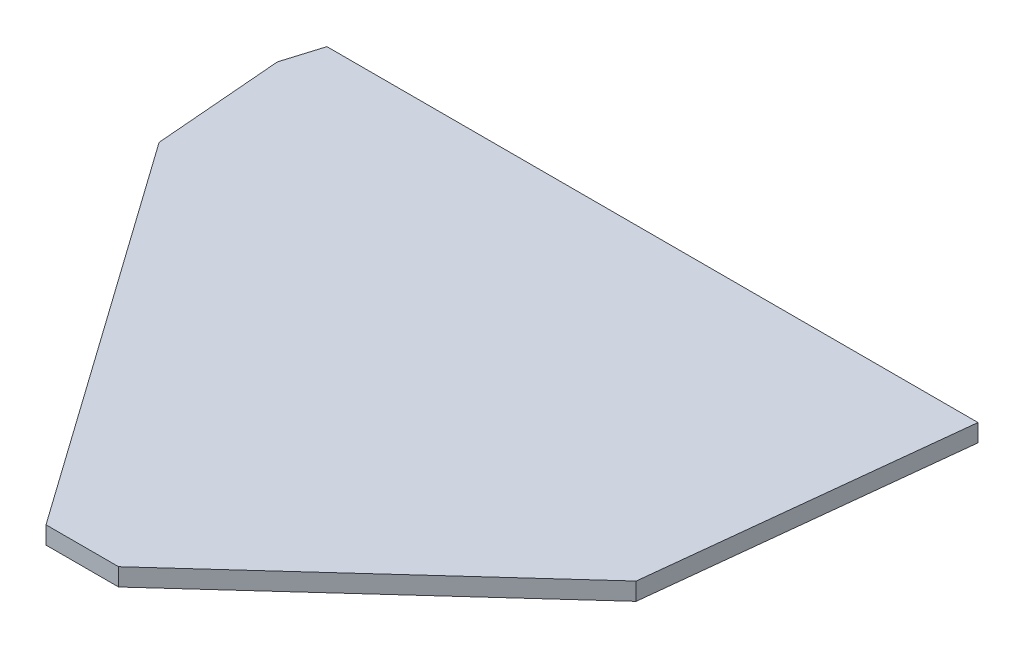
ISO-10303-21;
HEADER;
FILE_DESCRIPTION(('STEP AP214'),'2;1');
FILE_NAME('part.step','',(''),(''),'','','');
FILE_SCHEMA(('AUTOMOTIVE_DESIGN { 1 0 10303 214 1 1 1 1 }'));
ENDSEC;
DATA;
#1=APPLICATION_CONTEXT('core data for automotive mechanical design processes');
#2=APPLICATION_PROTOCOL_DEFINITION('international standard','automotive_design',2000,#1);
#3=PRODUCT_CONTEXT('',#1,'mechanical');
#4=PRODUCT('Part','Part','',(#3));
#5=PRODUCT_RELATED_PRODUCT_CATEGORY('part','',(#4));
#6=PRODUCT_DEFINITION_FORMATION('','',#4);
#7=PRODUCT_DEFINITION_CONTEXT('part definition',#1,'design');
#8=PRODUCT_DEFINITION('design','',#6,#7);
#9=PRODUCT_DEFINITION_SHAPE('','',#8);
#10=(LENGTH_UNIT() NAMED_UNIT(*) SI_UNIT(.MILLI.,.METRE.));
#11=(NAMED_UNIT(*) PLANE_ANGLE_UNIT() SI_UNIT($,.RADIAN.));
#12=(NAMED_UNIT(*) SI_UNIT($,.STERADIAN.) SOLID_ANGLE_UNIT());
#13=UNCERTAINTY_MEASURE_WITH_UNIT(LENGTH_MEASURE(1.E-05),#10,'distance_accuracy_value','');
#14=(GEOMETRIC_REPRESENTATION_CONTEXT(3) GLOBAL_UNCERTAINTY_ASSIGNED_CONTEXT((#13)) GLOBAL_UNIT_ASSIGNED_CONTEXT((#10,
#11,#12)) REPRESENTATION_CONTEXT('',''));
#15=CARTESIAN_POINT('',(0.,0.,0.));
#16=DIRECTION('',(0.,0.,1.));
#17=DIRECTION('',(1.,0.,0.));
#18=AXIS2_PLACEMENT_3D('',#15,#16,#17);
#19=CARTESIAN_POINT('',(8.24730328216522,2.,0.));
#20=DIRECTION('',(-0.6723289285992,0.,-0.740252532429746));
#21=DIRECTION('',(-0.740252532429746,0.,0.6723289285992));
#22=AXIS2_PLACEMENT_3D('',#19,#20,#21);
#23=PLANE('',#22);
#24=DIRECTION('',(0.740252532429746,0.,-0.6723289285992));
#25=VECTOR('',#24,1.);
#26=CARTESIAN_POINT('',(8.24730328216522,0.,0.));
#27=LINE('',#26,#25);
#28=CARTESIAN_POINT('',(8.24730328216522,0.,0.));
#29=VERTEX_POINT('',#28);
#30=CARTESIAN_POINT('',(39.0812425247596,0.,-28.0046989740407));
#31=VERTEX_POINT('',#30);
#32=EDGE_CURVE('E134',#29,#31,#27,.T.);
#33=ORIENTED_EDGE('',*,*,#32,.T.);
#34=DIRECTION('',(0.,-1.,0.));
#35=VECTOR('',#34,1.);
#36=CARTESIAN_POINT('',(39.0812425247596,2.,-28.0046989740407));
#37=LINE('',#36,#35);
#38=CARTESIAN_POINT('',(39.0812425247596,2.,-28.0046989740407));
#39=VERTEX_POINT('',#38);
#40=EDGE_CURVE('E11',#39,#31,#37,.T.);
#41=ORIENTED_EDGE('',*,*,#40,.F.);
#42=DIRECTION('',(0.740252532429746,0.,-0.6723289285992));
#43=VECTOR('',#42,1.);
#44=CARTESIAN_POINT('',(8.24730328216522,2.,0.));
#45=LINE('',#44,#43);
#46=CARTESIAN_POINT('',(8.24730328216522,2.,0.));
#47=VERTEX_POINT('',#46);
#48=EDGE_CURVE('E153',#47,#39,#45,.T.);
#49=ORIENTED_EDGE('',*,*,#48,.F.);
#50=DIRECTION('',(0.,-1.,0.));
#51=VECTOR('',#50,1.);
#52=CARTESIAN_POINT('',(8.24730328216522,2.,0.));
#53=LINE('',#52,#51);
#54=EDGE_CURVE('E130',#47,#29,#53,.T.);
#55=ORIENTED_EDGE('',*,*,#54,.T.);
#56=EDGE_LOOP('',(#33,#41,#49,#55));
#57=FACE_BOUND('',#56,.T.);
#58=ADVANCED_FACE('F39',(#57),#23,.F.);
#59=CARTESIAN_POINT('',(39.0812425247596,2.,-28.0046989740407));
#60=DIRECTION('',(-0.99409335428017,0.,-0.108528351024054));
#61=DIRECTION('',(-0.108528351024054,0.,0.99409335428017));
#62=AXIS2_PLACEMENT_3D('',#59,#60,#61);
#63=PLANE('',#62);
#64=DIRECTION('',(0.108528351024054,0.,-0.99409335428017));
#65=VECTOR('',#64,1.);
#66=CARTESIAN_POINT('',(39.0812425247596,0.,-28.0046989740407));
#67=LINE('',#66,#65);
#68=CARTESIAN_POINT('',(42.9062929931538,0.,-63.0412328800444));
#69=VERTEX_POINT('',#68);
#70=EDGE_CURVE('E138',#31,#69,#67,.T.);
#71=ORIENTED_EDGE('',*,*,#70,.T.);
#72=DIRECTION('',(0.,-1.,0.));
#73=VECTOR('',#72,1.);
#74=CARTESIAN_POINT('',(42.9062929931538,2.,-63.0412328800444));
#75=LINE('',#74,#73);
#76=CARTESIAN_POINT('',(42.9062929931538,2.,-63.0412328800444));
#77=VERTEX_POINT('',#76);
#78=EDGE_CURVE('E48',#77,#69,#75,.T.);
#79=ORIENTED_EDGE('',*,*,#78,.F.);
#80=DIRECTION('',(0.108528351024054,0.,-0.99409335428017));
#81=VECTOR('',#80,1.);
#82=CARTESIAN_POINT('',(39.0812425247596,2.,-28.0046989740407));
#83=LINE('',#82,#81);
#84=EDGE_CURVE('E96',#39,#77,#83,.T.);
#85=ORIENTED_EDGE('',*,*,#84,.F.);
#86=ORIENTED_EDGE('',*,*,#40,.T.);
#87=EDGE_LOOP('',(#71,#79,#85,#86));
#88=FACE_BOUND('',#87,.T.);
#89=ADVANCED_FACE('F187',(#88),#63,.F.);
#90=CARTESIAN_POINT('',(42.9062929931538,2.,-63.0412328800444));
#91=DIRECTION('',(0.,0.,1.));
#92=DIRECTION('',(1.,0.,0.));
#93=AXIS2_PLACEMENT_3D('',#90,#91,#92);
#94=PLANE('',#93);
#95=DIRECTION('',(-1.,0.,0.));
#96=VECTOR('',#95,1.);
#97=CARTESIAN_POINT('',(42.9062929931538,0.,-63.0412328800444));
#98=LINE('',#97,#96);
#99=CARTESIAN_POINT('',(-31.1055762438365,0.,-63.0412328800444));
#100=VERTEX_POINT('',#99);
#101=EDGE_CURVE('E141',#69,#100,#98,.T.);
#102=ORIENTED_EDGE('',*,*,#101,.T.);
#103=DIRECTION('',(0.,-1.,0.));
#104=VECTOR('',#103,1.);
#105=CARTESIAN_POINT('',(-31.1055762438365,2.,-63.0412328800444));
#106=LINE('',#105,#104);
#107=CARTESIAN_POINT('',(-31.1055762438365,2.,-63.0412328800444));
#108=VERTEX_POINT('',#107);
#109=EDGE_CURVE('E160',#108,#100,#106,.T.);
#110=ORIENTED_EDGE('',*,*,#109,.F.);
#111=DIRECTION('',(-1.,0.,0.));
#112=VECTOR('',#111,1.);
#113=CARTESIAN_POINT('',(42.9062929931538,2.,-63.0412328800444));
#114=LINE('',#113,#112);
#115=EDGE_CURVE('E170',#77,#108,#114,.T.);
#116=ORIENTED_EDGE('',*,*,#115,.F.);
#117=ORIENTED_EDGE('',*,*,#78,.T.);
#118=EDGE_LOOP('',(#102,#110,#116,#117));
#119=FACE_BOUND('',#118,.T.);
#120=ADVANCED_FACE('F168',(#119),#94,.F.);
#121=CARTESIAN_POINT('',(-31.1055762438365,2.,-63.0412328800444));
#122=DIRECTION('',(0.956567769493239,0.,0.29151003819205));
#123=DIRECTION('',(0.29151003819205,0.,-0.956567769493239));
#124=AXIS2_PLACEMENT_3D('',#121,#122,#123);
#125=PLANE('',#124);
#126=DIRECTION('',(-0.29151003819205,0.,0.956567769493238));
#127=VECTOR('',#126,1.);
#128=CARTESIAN_POINT('',(-31.1055762438365,0.,-63.0412328800444));
#129=LINE('',#128,#127);
#130=CARTESIAN_POINT('',(-32.4216205274037,0.,-58.7227347840825));
#131=VERTEX_POINT('',#130);
#132=EDGE_CURVE('E144',#100,#131,#129,.T.);
#133=ORIENTED_EDGE('',*,*,#132,.T.);
#134=DIRECTION('',(0.,-1.,0.));
#135=VECTOR('',#134,1.);
#136=CARTESIAN_POINT('',(-32.4216205274037,2.,-58.7227347840825));
#137=LINE('',#136,#135);
#138=CARTESIAN_POINT('',(-32.4216205274037,2.,-58.7227347840825));
#139=VERTEX_POINT('',#138);
#140=EDGE_CURVE('E123',#139,#131,#137,.T.);
#141=ORIENTED_EDGE('',*,*,#140,.F.);
#142=DIRECTION('',(-0.29151003819205,0.,0.956567769493238));
#143=VECTOR('',#142,1.);
#144=CARTESIAN_POINT('',(-31.1055762438365,2.,-63.0412328800444));
#145=LINE('',#144,#143);
#146=EDGE_CURVE('E112',#108,#139,#145,.T.);
#147=ORIENTED_EDGE('',*,*,#146,.F.);
#148=ORIENTED_EDGE('',*,*,#109,.T.);
#149=EDGE_LOOP('',(#133,#141,#147,#148));
#150=FACE_BOUND('',#149,.T.);
#151=ADVANCED_FACE('F176',(#150),#125,.F.);
#152=CARTESIAN_POINT('',(-32.4216205274037,2.,-58.7227347840825));
#153=DIRECTION('',(0.996659222641631,0.,-0.0816724795961254));
#154=DIRECTION('',(-0.0816724795961254,0.,-0.996659222641631));
#155=AXIS2_PLACEMENT_3D('',#152,#153,#154);
#156=PLANE('',#155);
#157=DIRECTION('',(0.0816724795961254,0.,0.996659222641631));
#158=VECTOR('',#157,1.);
#159=CARTESIAN_POINT('',(-32.4216205274037,0.,-58.7227347840825));
#160=LINE('',#159,#158);
#161=CARTESIAN_POINT('',(-31.221557335832,0.,-44.0782173952732));
#162=VERTEX_POINT('',#161);
#163=EDGE_CURVE('E121',#131,#162,#160,.T.);
#164=ORIENTED_EDGE('',*,*,#163,.T.);
#165=DIRECTION('',(0.,-1.,0.));
#166=VECTOR('',#165,1.);
#167=CARTESIAN_POINT('',(-31.221557335832,2.,-44.0782173952732));
#168=LINE('',#167,#166);
#169=CARTESIAN_POINT('',(-31.221557335832,2.,-44.0782173952732));
#170=VERTEX_POINT('',#169);
#171=EDGE_CURVE('E118',#170,#162,#168,.T.);
#172=ORIENTED_EDGE('',*,*,#171,.F.);
#173=DIRECTION('',(0.0816724795961254,0.,0.996659222641631));
#174=VECTOR('',#173,1.);
#175=CARTESIAN_POINT('',(-32.4216205274037,2.,-58.7227347840825));
#176=LINE('',#175,#174);
#177=EDGE_CURVE('E106',#139,#170,#176,.T.);
#178=ORIENTED_EDGE('',*,*,#177,.F.);
#179=ORIENTED_EDGE('',*,*,#140,.T.);
#180=EDGE_LOOP('',(#164,#172,#178,#179));
#181=FACE_BOUND('',#180,.T.);
#182=ADVANCED_FACE('F119',(#181),#156,.F.);
#183=CARTESIAN_POINT('',(-31.221557335832,2.,-44.0782173952732));
#184=DIRECTION('',(0.816028963502573,0.,-0.578011012632905));
#185=DIRECTION('',(-0.578011012632905,0.,-0.816028963502573));
#186=AXIS2_PLACEMENT_3D('',#183,#184,#185);
#187=PLANE('',#186);
#188=DIRECTION('',(0.578011012632905,0.,0.816028963502573));
#189=VECTOR('',#188,1.);
#190=CARTESIAN_POINT('',(-31.221557335832,0.,-44.0782173952732));
#191=LINE('',#190,#189);
#192=CARTESIAN_POINT('',(0.,0.,0.));
#193=VERTEX_POINT('',#192);
#194=EDGE_CURVE('E82',#162,#193,#191,.T.);
#195=ORIENTED_EDGE('',*,*,#194,.T.);
#196=DIRECTION('',(0.,-1.,0.));
#197=VECTOR('',#196,1.);
#198=CARTESIAN_POINT('',(0.,2.,0.));
#199=LINE('',#198,#197);
#200=CARTESIAN_POINT('',(0.,2.,0.));
#201=VERTEX_POINT('',#200);
#202=EDGE_CURVE('E124',#201,#193,#199,.T.);
#203=ORIENTED_EDGE('',*,*,#202,.F.);
#204=DIRECTION('',(0.578011012632905,0.,0.816028963502573));
#205=VECTOR('',#204,1.);
#206=CARTESIAN_POINT('',(-31.221557335832,2.,-44.0782173952732));
#207=LINE('',#206,#205);
#208=EDGE_CURVE('E110',#170,#201,#207,.T.);
#209=ORIENTED_EDGE('',*,*,#208,.F.);
#210=ORIENTED_EDGE('',*,*,#171,.T.);
#211=EDGE_LOOP('',(#195,#203,#209,#210));
#212=FACE_BOUND('',#211,.T.);
#213=ADVANCED_FACE('F126',(#212),#187,.F.);
#214=CARTESIAN_POINT('',(0.,2.,0.));
#215=DIRECTION('',(0.,0.,-1.));
#216=DIRECTION('',(-1.,0.,0.));
#217=AXIS2_PLACEMENT_3D('',#214,#215,#216);
#218=PLANE('',#217);
#219=DIRECTION('',(1.,0.,0.));
#220=VECTOR('',#219,1.);
#221=CARTESIAN_POINT('',(0.,0.,0.));
#222=LINE('',#221,#220);
#223=EDGE_CURVE('E88',#193,#29,#222,.T.);
#224=ORIENTED_EDGE('',*,*,#223,.T.);
#225=ORIENTED_EDGE('',*,*,#54,.F.);
#226=DIRECTION('',(1.,0.,0.));
#227=VECTOR('',#226,1.);
#228=CARTESIAN_POINT('',(0.,2.,0.));
#229=LINE('',#228,#227);
#230=EDGE_CURVE('E56',#201,#47,#229,.T.);
#231=ORIENTED_EDGE('',*,*,#230,.F.);
#232=ORIENTED_EDGE('',*,*,#202,.T.);
#233=EDGE_LOOP('',(#224,#225,#231,#232));
#234=FACE_BOUND('',#233,.T.);
#235=ADVANCED_FACE('F201',(#234),#218,.F.);
#236=CARTESIAN_POINT('',(0.,2.,0.));
#237=DIRECTION('',(0.,-1.,0.));
#238=DIRECTION('',(0.,0.,-1.));
#239=AXIS2_PLACEMENT_3D('',#236,#237,#238);
#240=PLANE('',#239);
#241=ORIENTED_EDGE('',*,*,#48,.T.);
#242=ORIENTED_EDGE('',*,*,#84,.T.);
#243=ORIENTED_EDGE('',*,*,#115,.T.);
#244=ORIENTED_EDGE('',*,*,#146,.T.);
#245=ORIENTED_EDGE('',*,*,#177,.T.);
#246=ORIENTED_EDGE('',*,*,#208,.T.);
#247=ORIENTED_EDGE('',*,*,#230,.T.);
#248=EDGE_LOOP('',(#241,#242,#243,#244,#245,#246,#247));
#249=FACE_BOUND('',#248,.T.);
#250=ADVANCED_FACE('F108',(#249),#240,.F.);
#251=CARTESIAN_POINT('',(0.,0.,0.));
#252=DIRECTION('',(0.,-1.,0.));
#253=DIRECTION('',(0.,0.,-1.));
#254=AXIS2_PLACEMENT_3D('',#251,#252,#253);
#255=PLANE('',#254);
#256=ORIENTED_EDGE('',*,*,#32,.F.);
#257=ORIENTED_EDGE('',*,*,#223,.F.);
#258=ORIENTED_EDGE('',*,*,#194,.F.);
#259=ORIENTED_EDGE('',*,*,#163,.F.);
#260=ORIENTED_EDGE('',*,*,#132,.F.);
#261=ORIENTED_EDGE('',*,*,#101,.F.);
#262=ORIENTED_EDGE('',*,*,#70,.F.);
#263=EDGE_LOOP('',(#256,#257,#258,#259,#260,#261,#262));
#264=FACE_BOUND('',#263,.T.);
#265=ADVANCED_FACE('F174',(#264),#255,.T.);
#266=CLOSED_SHELL('',(#58,#89,#120,#151,#182,#213,#235,#250,#265));
#267=MANIFOLD_SOLID_BREP('B2',#266);
#268=ADVANCED_BREP_SHAPE_REPRESENTATION('',(#18,#267),#14);
#269=SHAPE_DEFINITION_REPRESENTATION(#9,#268);
ENDSEC;
END-ISO-10303-21;
